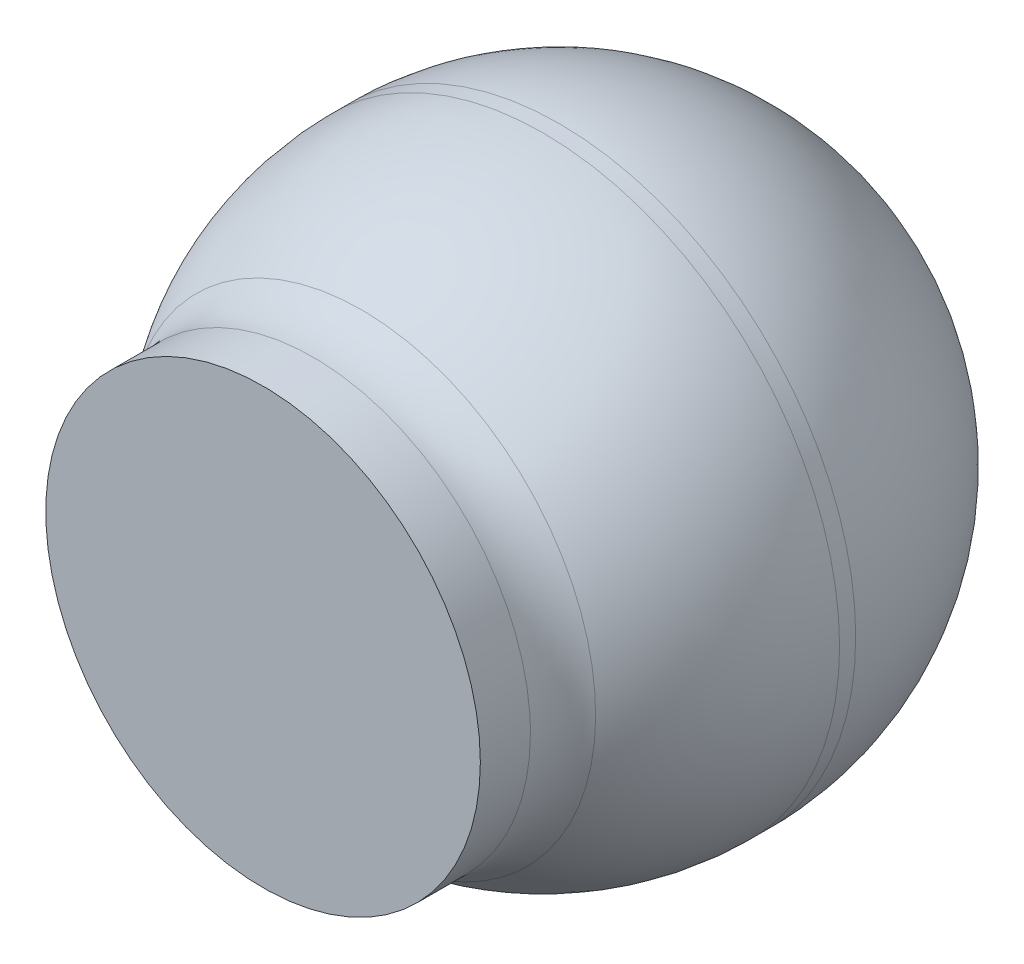
ISO-10303-21;
HEADER;
FILE_DESCRIPTION(('STEP AP214'),'2;1');
FILE_NAME('part.step','',(''),(''),'','','');
FILE_SCHEMA(('AUTOMOTIVE_DESIGN { 1 0 10303 214 1 1 1 1 }'));
ENDSEC;
DATA;
#1=APPLICATION_CONTEXT('core data for automotive mechanical design processes');
#2=APPLICATION_PROTOCOL_DEFINITION('international standard','automotive_design',2000,#1);
#3=PRODUCT_CONTEXT('',#1,'mechanical');
#4=PRODUCT('Part','Part','',(#3));
#5=PRODUCT_RELATED_PRODUCT_CATEGORY('part','',(#4));
#6=PRODUCT_DEFINITION_FORMATION('','',#4);
#7=PRODUCT_DEFINITION_CONTEXT('part definition',#1,'design');
#8=PRODUCT_DEFINITION('design','',#6,#7);
#9=PRODUCT_DEFINITION_SHAPE('','',#8);
#10=(LENGTH_UNIT() NAMED_UNIT(*) SI_UNIT(.MILLI.,.METRE.));
#11=(NAMED_UNIT(*) PLANE_ANGLE_UNIT() SI_UNIT($,.RADIAN.));
#12=(NAMED_UNIT(*) SI_UNIT($,.STERADIAN.) SOLID_ANGLE_UNIT());
#13=UNCERTAINTY_MEASURE_WITH_UNIT(LENGTH_MEASURE(1.E-05),#10,'distance_accuracy_value','');
#14=(GEOMETRIC_REPRESENTATION_CONTEXT(3) GLOBAL_UNCERTAINTY_ASSIGNED_CONTEXT((#13)) GLOBAL_UNIT_ASSIGNED_CONTEXT((#10,
#11,#12)) REPRESENTATION_CONTEXT('',''));
#15=CARTESIAN_POINT('',(0.,0.,0.));
#16=DIRECTION('',(0.,0.,1.));
#17=DIRECTION('',(1.,0.,0.));
#18=AXIS2_PLACEMENT_3D('',#15,#16,#17);
#19=CARTESIAN_POINT('',(-0.562919922269,-9.131349291452,10.006534503384));
#20=DIRECTION('',(0.,0.,-1.));
#21=DIRECTION('',(-1.,0.,0.));
#22=AXIS2_PLACEMENT_3D('',#19,#20,#21);
#23=PLANE('',#22);
#24=CARTESIAN_POINT('',(-0.562919922269,-9.131349291452,10.006534503384));
#25=DIRECTION('',(0.,0.,1.));
#26=DIRECTION('',(1.,0.,0.));
#27=AXIS2_PLACEMENT_3D('',#24,#25,#26);
#28=CIRCLE('',#27,0.275);
#29=CARTESIAN_POINT('',(-0.287919922269,-9.131349291452,10.006534503384));
#30=VERTEX_POINT('',#29);
#31=EDGE_CURVE('E20',#30,#30,#28,.F.);
#32=ORIENTED_EDGE('',*,*,#31,.F.);
#33=EDGE_LOOP('',(#32));
#34=FACE_BOUND('',#33,.T.);
#35=ADVANCED_FACE('F17',(#34),#23,.F.);
#36=CARTESIAN_POINT('',(-0.562919922269,-9.131349291452,9.906534503384));
#37=DIRECTION('',(0.,0.,1.));
#38=DIRECTION('',(1.,0.,0.));
#39=AXIS2_PLACEMENT_3D('',#36,#37,#38);
#40=CYLINDRICAL_SURFACE('',#39,0.275);
#41=CARTESIAN_POINT('',(-0.562919922269,-9.131349291452,9.943180457728));
#42=DIRECTION('',(0.,0.,-1.));
#43=DIRECTION('',(0.996700902337582,0.081162252799247,0.));
#44=AXIS2_PLACEMENT_3D('',#41,#42,#43);
#45=CIRCLE('',#44,0.275);
#46=CARTESIAN_POINT('',(-0.288827174126165,-9.10902967193221,9.943180457728));
#47=VERTEX_POINT('',#46);
#48=EDGE_CURVE('E65',#47,#47,#45,.F.);
#49=ORIENTED_EDGE('',*,*,#48,.T.);
#50=EDGE_LOOP('',(#49));
#51=FACE_BOUND('',#50,.T.);
#52=ORIENTED_EDGE('',*,*,#31,.T.);
#53=EDGE_LOOP('',(#52));
#54=FACE_BOUND('',#53,.T.);
#55=ADVANCED_FACE('F62',(#51,#54),#40,.T.);
#56=CARTESIAN_POINT('',(-0.562919922269,-9.131349291452,9.943180457728));
#57=DIRECTION('',(0.,0.,-1.));
#58=DIRECTION('',(0.996700902337583,0.0811622527992449,0.));
#59=AXIS2_PLACEMENT_3D('',#56,#57,#58);
#60=TOROIDAL_SURFACE('',#59,0.375,0.1);
#61=ORIENTED_EDGE('',*,*,#48,.F.);
#62=EDGE_LOOP('',(#61));
#63=FACE_BOUND('',#62,.T.);
#64=CARTESIAN_POINT('',(-0.562919922268999,-9.131349291452,9.881744931236));
#65=DIRECTION('',(0.,0.,-1.));
#66=DIRECTION('',(-0.996700902337597,-0.0811622527990622,0.));
#67=AXIS2_PLACEMENT_3D('',#64,#65,#66);
#68=CIRCLE('',#67,0.296097046412665);
#69=CARTESIAN_POINT('',(-0.858040115608,-9.155381194786,9.881744931236));
#70=VERTEX_POINT('',#69);
#71=EDGE_CURVE('E39',#70,#70,#68,.T.);
#72=ORIENTED_EDGE('',*,*,#71,.F.);
#73=EDGE_LOOP('',(#72));
#74=FACE_BOUND('',#73,.T.);
#75=ADVANCED_FACE('F57',(#63,#74),#60,.F.);
#76=CARTESIAN_POINT('',(-0.936682760645,-9.161785136252,9.651976062157));
#77=CARTESIAN_POINT('',(-0.936682760645,-9.161785136252,9.701461392103));
#78=CARTESIAN_POINT('',(-0.928526217348,-9.161120941579,9.750947004335));
#79=CARTESIAN_POINT('',(-0.912207085349,-9.159792059952,9.798626332798));
#80=CARTESIAN_POINT('',(-0.888341390838,-9.157848654938,9.842699544317));
#81=CARTESIAN_POINT('',(-0.858040115608,-9.155381194786,9.881744931236));
#82=(BOUNDED_CURVE() B_SPLINE_CURVE(5,(#76,#77,#78,#79,#80,#81),.UNSPECIFIED.,.F.,
.F.) B_SPLINE_CURVE_WITH_KNOTS((6,6),(0.,0.661568582165),
.UNSPECIFIED.) CURVE() GEOMETRIC_REPRESENTATION_ITEM() RATIONAL_B_SPLINE_CURVE((1.,1.,1.,1.,1.,1.)) REPRESENTATION_ITEM(''));
#83=CARTESIAN_POINT('',(-0.562919922269,-9.131349291452,9.651976062157));
#84=DIRECTION('',(0.,0.,-1.));
#85=AXIS1_PLACEMENT('',#83,#84);
#86=SURFACE_OF_REVOLUTION('',#82,#85);
#87=CARTESIAN_POINT('',(-0.562919922268999,-9.131349291452,9.651976062157));
#88=DIRECTION('',(0.,0.,1.));
#89=DIRECTION('',(1.,0.,0.));
#90=AXIS2_PLACEMENT_3D('',#87,#88,#89);
#91=CIRCLE('',#90,0.375);
#92=CARTESIAN_POINT('',(-0.187919922268999,-9.131349291452,9.651976062157));
#93=VERTEX_POINT('',#92);
#94=EDGE_CURVE('E36',#93,#93,#91,.F.);
#95=ORIENTED_EDGE('',*,*,#94,.F.);
#96=EDGE_LOOP('',(#95));
#97=FACE_BOUND('',#96,.T.);
#98=ORIENTED_EDGE('',*,*,#71,.T.);
#99=EDGE_LOOP('',(#98));
#100=FACE_BOUND('',#99,.T.);
#101=ADVANCED_FACE('F53',(#97,#100),#86,.F.);
#102=CARTESIAN_POINT('',(-0.562919922269,-9.131349291452,9.256534503384));
#103=DIRECTION('',(0.,0.,1.));
#104=DIRECTION('',(1.,0.,0.));
#105=AXIS2_PLACEMENT_3D('',#102,#103,#104);
#106=CYLINDRICAL_SURFACE('',#105,0.375);
#107=CARTESIAN_POINT('',(-0.562919922269,-9.131349291452,9.631534503384));
#108=DIRECTION('',(0.,0.,-1.));
#109=DIRECTION('',(0.0811622527992362,-0.996700902337583,0.));
#110=AXIS2_PLACEMENT_3D('',#107,#108,#109);
#111=CIRCLE('',#110,0.375);
#112=CARTESIAN_POINT('',(-0.532484077469287,-9.50511212982859,9.631534503384));
#113=VERTEX_POINT('',#112);
#114=CARTESIAN_POINT('',(-0.593355767068713,-8.75758645307541,9.631534503384));
#115=VERTEX_POINT('',#114);
#116=EDGE_CURVE('E11',#113,#115,#111,.T.);
#117=ORIENTED_EDGE('',*,*,#116,.F.);
#118=CARTESIAN_POINT('',(-0.562919922269,-9.131349291452,9.631534503384));
#119=DIRECTION('',(0.,0.,1.));
#120=DIRECTION('',(0.0811622527992359,-0.996700902337583,0.));
#121=AXIS2_PLACEMENT_3D('',#118,#119,#120);
#122=CIRCLE('',#121,0.375);
#123=EDGE_CURVE('E25',#115,#113,#122,.F.);
#124=ORIENTED_EDGE('',*,*,#123,.F.);
#125=EDGE_LOOP('',(#117,#124));
#126=FACE_BOUND('',#125,.T.);
#127=ORIENTED_EDGE('',*,*,#94,.T.);
#128=EDGE_LOOP('',(#127));
#129=FACE_BOUND('',#128,.T.);
#130=ADVANCED_FACE('F34',(#126,#129),#106,.T.);
#131=CARTESIAN_POINT('',(-0.562919922269,-9.131349291452,9.631534503384));
#132=DIRECTION('',(0.0811622527992361,-0.996700902337583,0.));
#133=DIRECTION('',(-0.996700902337583,-0.0811622527992361,0.));
#134=AXIS2_PLACEMENT_3D('',#131,#132,#133);
#135=SPHERICAL_SURFACE('',#134,0.375);
#136=ORIENTED_EDGE('',*,*,#123,.T.);
#137=ORIENTED_EDGE('',*,*,#116,.T.);
#138=EDGE_LOOP('',(#136,#137));
#139=FACE_BOUND('',#138,.T.);
#140=ADVANCED_FACE('F32',(#139),#135,.T.);
#141=CLOSED_SHELL('',(#35,#55,#75,#101,#130,#140));
#142=MANIFOLD_SOLID_BREP('B1',#141);
#143=ADVANCED_BREP_SHAPE_REPRESENTATION('',(#18,#142),#14);
#144=SHAPE_DEFINITION_REPRESENTATION(#9,#143);
ENDSEC;
END-ISO-10303-21;
